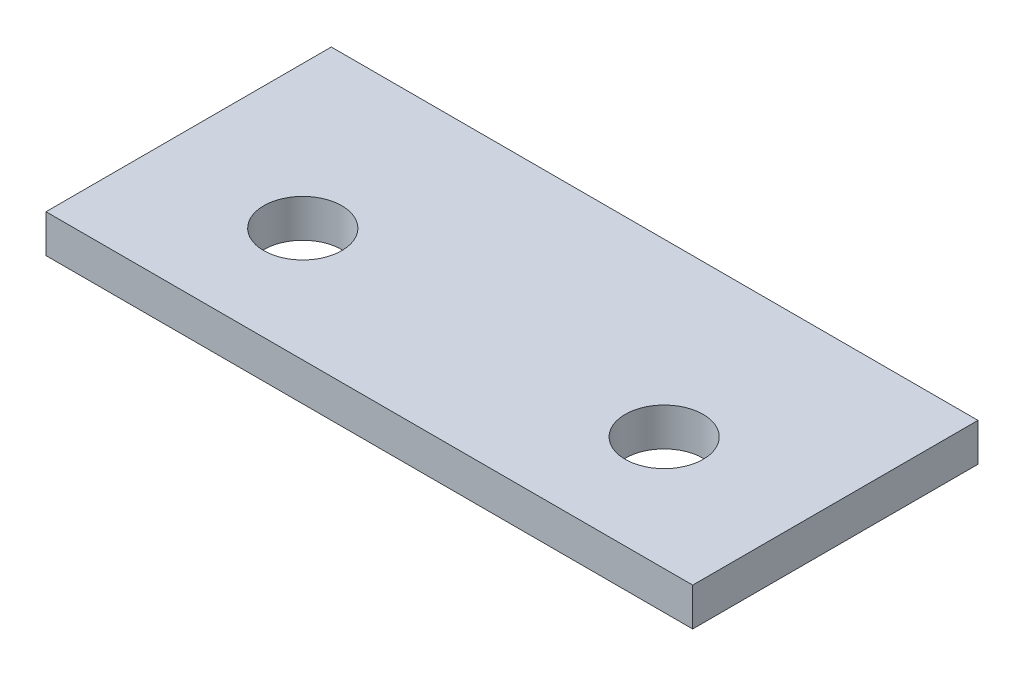
ISO-10303-21;
HEADER;
FILE_DESCRIPTION(('STEP AP214'),'2;1');
FILE_NAME('part.step','',(''),(''),'','','');
FILE_SCHEMA(('AUTOMOTIVE_DESIGN { 1 0 10303 214 1 1 1 1 }'));
ENDSEC;
DATA;
#1=APPLICATION_CONTEXT('core data for automotive mechanical design processes');
#2=APPLICATION_PROTOCOL_DEFINITION('international standard','automotive_design',2000,#1);
#3=PRODUCT_CONTEXT('',#1,'mechanical');
#4=PRODUCT('Part','Part','',(#3));
#5=PRODUCT_RELATED_PRODUCT_CATEGORY('part','',(#4));
#6=PRODUCT_DEFINITION_FORMATION('','',#4);
#7=PRODUCT_DEFINITION_CONTEXT('part definition',#1,'design');
#8=PRODUCT_DEFINITION('design','',#6,#7);
#9=PRODUCT_DEFINITION_SHAPE('','',#8);
#10=(LENGTH_UNIT() NAMED_UNIT(*) SI_UNIT(.MILLI.,.METRE.));
#11=(NAMED_UNIT(*) PLANE_ANGLE_UNIT() SI_UNIT($,.RADIAN.));
#12=(NAMED_UNIT(*) SI_UNIT($,.STERADIAN.) SOLID_ANGLE_UNIT());
#13=UNCERTAINTY_MEASURE_WITH_UNIT(LENGTH_MEASURE(1.E-05),#10,'distance_accuracy_value','');
#14=(GEOMETRIC_REPRESENTATION_CONTEXT(3) GLOBAL_UNCERTAINTY_ASSIGNED_CONTEXT((#13)) GLOBAL_UNIT_ASSIGNED_CONTEXT((#10,
#11,#12)) REPRESENTATION_CONTEXT('',''));
#15=CARTESIAN_POINT('',(0.,0.,0.));
#16=DIRECTION('',(0.,0.,1.));
#17=DIRECTION('',(1.,0.,0.));
#18=AXIS2_PLACEMENT_3D('',#15,#16,#17);
#19=CARTESIAN_POINT('',(0.,4.,0.));
#20=DIRECTION('',(0.,-1.,0.));
#21=DIRECTION('',(0.,0.,-1.));
#22=AXIS2_PLACEMENT_3D('',#19,#20,#21);
#23=PLANE('',#22);
#24=DIRECTION('',(0.,0.,1.));
#25=VECTOR('',#24,1.);
#26=CARTESIAN_POINT('',(0.,4.,0.));
#27=LINE('',#26,#25);
#28=CARTESIAN_POINT('',(0.,4.,-30.));
#29=VERTEX_POINT('',#28);
#30=CARTESIAN_POINT('',(0.,4.,0.));
#31=VERTEX_POINT('',#30);
#32=EDGE_CURVE('E87',#29,#31,#27,.T.);
#33=ORIENTED_EDGE('',*,*,#32,.T.);
#34=DIRECTION('',(1.,0.,0.));
#35=VECTOR('',#34,1.);
#36=CARTESIAN_POINT('',(0.,4.,0.));
#37=LINE('',#36,#35);
#38=CARTESIAN_POINT('',(68.,4.,0.));
#39=VERTEX_POINT('',#38);
#40=EDGE_CURVE('E82',#31,#39,#37,.T.);
#41=ORIENTED_EDGE('',*,*,#40,.T.);
#42=DIRECTION('',(0.,0.,-1.));
#43=VECTOR('',#42,1.);
#44=CARTESIAN_POINT('',(68.,4.,0.));
#45=LINE('',#44,#43);
#46=CARTESIAN_POINT('',(68.,4.,-30.));
#47=VERTEX_POINT('',#46);
#48=EDGE_CURVE('E85',#39,#47,#45,.T.);
#49=ORIENTED_EDGE('',*,*,#48,.T.);
#50=DIRECTION('',(-1.,0.,0.));
#51=VECTOR('',#50,1.);
#52=CARTESIAN_POINT('',(0.,4.,-30.));
#53=LINE('',#52,#51);
#54=EDGE_CURVE('E52',#47,#29,#53,.T.);
#55=ORIENTED_EDGE('',*,*,#54,.T.);
#56=EDGE_LOOP('',(#33,#41,#49,#55));
#57=FACE_BOUND('',#56,.T.);
#58=CARTESIAN_POINT('',(15.,4.,-12.));
#59=DIRECTION('',(0.,1.,0.));
#60=DIRECTION('',(0.,0.,1.));
#61=AXIS2_PLACEMENT_3D('',#58,#59,#60);
#62=CIRCLE('',#61,4.1);
#63=CARTESIAN_POINT('',(15.,4.,-7.9));
#64=VERTEX_POINT('',#63);
#65=EDGE_CURVE('E102',#64,#64,#62,.T.);
#66=ORIENTED_EDGE('',*,*,#65,.F.);
#67=EDGE_LOOP('',(#66));
#68=FACE_BOUND('',#67,.T.);
#69=CARTESIAN_POINT('',(53.,4.,-12.));
#70=DIRECTION('',(0.,1.,0.));
#71=DIRECTION('',(0.,0.,-1.));
#72=AXIS2_PLACEMENT_3D('',#69,#70,#71);
#73=CIRCLE('',#72,4.1);
#74=CARTESIAN_POINT('',(53.,4.,-16.1));
#75=VERTEX_POINT('',#74);
#76=EDGE_CURVE('E117',#75,#75,#73,.T.);
#77=ORIENTED_EDGE('',*,*,#76,.F.);
#78=EDGE_LOOP('',(#77));
#79=FACE_BOUND('',#78,.T.);
#80=ADVANCED_FACE('F35',(#57,#68,#79),#23,.F.);
#81=CARTESIAN_POINT('',(0.,0.,0.));
#82=DIRECTION('',(0.,-1.,0.));
#83=DIRECTION('',(0.,0.,-1.));
#84=AXIS2_PLACEMENT_3D('',#81,#82,#83);
#85=PLANE('',#84);
#86=CARTESIAN_POINT('',(15.,0.,-12.));
#87=DIRECTION('',(0.,1.,0.));
#88=DIRECTION('',(0.,0.,1.));
#89=AXIS2_PLACEMENT_3D('',#86,#87,#88);
#90=CIRCLE('',#89,4.1);
#91=CARTESIAN_POINT('',(15.,0.,-7.9));
#92=VERTEX_POINT('',#91);
#93=EDGE_CURVE('E114',#92,#92,#90,.T.);
#94=ORIENTED_EDGE('',*,*,#93,.T.);
#95=EDGE_LOOP('',(#94));
#96=FACE_BOUND('',#95,.T.);
#97=DIRECTION('',(0.,0.,1.));
#98=VECTOR('',#97,1.);
#99=CARTESIAN_POINT('',(0.,0.,0.));
#100=LINE('',#99,#98);
#101=CARTESIAN_POINT('',(0.,0.,-30.));
#102=VERTEX_POINT('',#101);
#103=CARTESIAN_POINT('',(0.,0.,0.));
#104=VERTEX_POINT('',#103);
#105=EDGE_CURVE('E99',#102,#104,#100,.T.);
#106=ORIENTED_EDGE('',*,*,#105,.F.);
#107=DIRECTION('',(-1.,0.,0.));
#108=VECTOR('',#107,1.);
#109=CARTESIAN_POINT('',(0.,0.,-30.));
#110=LINE('',#109,#108);
#111=CARTESIAN_POINT('',(68.,0.,-30.));
#112=VERTEX_POINT('',#111);
#113=EDGE_CURVE('E75',#112,#102,#110,.T.);
#114=ORIENTED_EDGE('',*,*,#113,.F.);
#115=DIRECTION('',(0.,0.,-1.));
#116=VECTOR('',#115,1.);
#117=CARTESIAN_POINT('',(68.,0.,0.));
#118=LINE('',#117,#116);
#119=CARTESIAN_POINT('',(68.,0.,0.));
#120=VERTEX_POINT('',#119);
#121=EDGE_CURVE('E69',#120,#112,#118,.T.);
#122=ORIENTED_EDGE('',*,*,#121,.F.);
#123=DIRECTION('',(1.,0.,0.));
#124=VECTOR('',#123,1.);
#125=CARTESIAN_POINT('',(0.,0.,0.));
#126=LINE('',#125,#124);
#127=EDGE_CURVE('E91',#104,#120,#126,.T.);
#128=ORIENTED_EDGE('',*,*,#127,.F.);
#129=EDGE_LOOP('',(#106,#114,#122,#128));
#130=FACE_BOUND('',#129,.T.);
#131=CARTESIAN_POINT('',(53.,0.,-12.));
#132=DIRECTION('',(0.,1.,0.));
#133=DIRECTION('',(0.,0.,-1.));
#134=AXIS2_PLACEMENT_3D('',#131,#132,#133);
#135=CIRCLE('',#134,4.1);
#136=CARTESIAN_POINT('',(53.,0.,-16.1));
#137=VERTEX_POINT('',#136);
#138=EDGE_CURVE('E120',#137,#137,#135,.T.);
#139=ORIENTED_EDGE('',*,*,#138,.T.);
#140=EDGE_LOOP('',(#139));
#141=FACE_BOUND('',#140,.T.);
#142=ADVANCED_FACE('F110',(#96,#130,#141),#85,.T.);
#143=CARTESIAN_POINT('',(0.,4.,0.));
#144=DIRECTION('',(1.,0.,0.));
#145=DIRECTION('',(0.,0.,-1.));
#146=AXIS2_PLACEMENT_3D('',#143,#144,#145);
#147=PLANE('',#146);
#148=ORIENTED_EDGE('',*,*,#105,.T.);
#149=DIRECTION('',(0.,-1.,0.));
#150=VECTOR('',#149,1.);
#151=CARTESIAN_POINT('',(0.,4.,0.));
#152=LINE('',#151,#150);
#153=EDGE_CURVE('E11',#31,#104,#152,.T.);
#154=ORIENTED_EDGE('',*,*,#153,.F.);
#155=ORIENTED_EDGE('',*,*,#32,.F.);
#156=DIRECTION('',(0.,-1.,0.));
#157=VECTOR('',#156,1.);
#158=CARTESIAN_POINT('',(0.,4.,-30.));
#159=LINE('',#158,#157);
#160=EDGE_CURVE('E95',#29,#102,#159,.T.);
#161=ORIENTED_EDGE('',*,*,#160,.T.);
#162=EDGE_LOOP('',(#148,#154,#155,#161));
#163=FACE_BOUND('',#162,.T.);
#164=ADVANCED_FACE('F37',(#163),#147,.F.);
#165=CARTESIAN_POINT('',(0.,4.,0.));
#166=DIRECTION('',(0.,0.,-1.));
#167=DIRECTION('',(-1.,0.,0.));
#168=AXIS2_PLACEMENT_3D('',#165,#166,#167);
#169=PLANE('',#168);
#170=ORIENTED_EDGE('',*,*,#127,.T.);
#171=DIRECTION('',(0.,-1.,0.));
#172=VECTOR('',#171,1.);
#173=CARTESIAN_POINT('',(68.,4.,0.));
#174=LINE('',#173,#172);
#175=EDGE_CURVE('E44',#39,#120,#174,.T.);
#176=ORIENTED_EDGE('',*,*,#175,.F.);
#177=ORIENTED_EDGE('',*,*,#40,.F.);
#178=ORIENTED_EDGE('',*,*,#153,.T.);
#179=EDGE_LOOP('',(#170,#176,#177,#178));
#180=FACE_BOUND('',#179,.T.);
#181=ADVANCED_FACE('F90',(#180),#169,.F.);
#182=CARTESIAN_POINT('',(68.,4.,0.));
#183=DIRECTION('',(-1.,0.,0.));
#184=DIRECTION('',(0.,0.,1.));
#185=AXIS2_PLACEMENT_3D('',#182,#183,#184);
#186=PLANE('',#185);
#187=ORIENTED_EDGE('',*,*,#121,.T.);
#188=DIRECTION('',(0.,-1.,0.));
#189=VECTOR('',#188,1.);
#190=CARTESIAN_POINT('',(68.,4.,-30.));
#191=LINE('',#190,#189);
#192=EDGE_CURVE('E92',#47,#112,#191,.T.);
#193=ORIENTED_EDGE('',*,*,#192,.F.);
#194=ORIENTED_EDGE('',*,*,#48,.F.);
#195=ORIENTED_EDGE('',*,*,#175,.T.);
#196=EDGE_LOOP('',(#187,#193,#194,#195));
#197=FACE_BOUND('',#196,.T.);
#198=ADVANCED_FACE('F93',(#197),#186,.F.);
#199=CARTESIAN_POINT('',(0.,4.,-30.));
#200=DIRECTION('',(0.,0.,1.));
#201=DIRECTION('',(1.,0.,0.));
#202=AXIS2_PLACEMENT_3D('',#199,#200,#201);
#203=PLANE('',#202);
#204=ORIENTED_EDGE('',*,*,#113,.T.);
#205=ORIENTED_EDGE('',*,*,#160,.F.);
#206=ORIENTED_EDGE('',*,*,#54,.F.);
#207=ORIENTED_EDGE('',*,*,#192,.T.);
#208=EDGE_LOOP('',(#204,#205,#206,#207));
#209=FACE_BOUND('',#208,.T.);
#210=ADVANCED_FACE('F107',(#209),#203,.F.);
#211=CARTESIAN_POINT('',(15.,4.,-12.));
#212=DIRECTION('',(0.,-1.,0.));
#213=DIRECTION('',(0.,0.,-1.));
#214=AXIS2_PLACEMENT_3D('',#211,#212,#213);
#215=CYLINDRICAL_SURFACE('',#214,4.1);
#216=ORIENTED_EDGE('',*,*,#65,.T.);
#217=EDGE_LOOP('',(#216));
#218=FACE_BOUND('',#217,.T.);
#219=ORIENTED_EDGE('',*,*,#93,.F.);
#220=EDGE_LOOP('',(#219));
#221=FACE_BOUND('',#220,.T.);
#222=ADVANCED_FACE('F137',(#218,#221),#215,.F.);
#223=CARTESIAN_POINT('',(53.,4.,-12.));
#224=DIRECTION('',(0.,-1.,0.));
#225=DIRECTION('',(0.,0.,-1.));
#226=AXIS2_PLACEMENT_3D('',#223,#224,#225);
#227=CYLINDRICAL_SURFACE('',#226,4.1);
#228=ORIENTED_EDGE('',*,*,#76,.T.);
#229=EDGE_LOOP('',(#228));
#230=FACE_BOUND('',#229,.T.);
#231=ORIENTED_EDGE('',*,*,#138,.F.);
#232=EDGE_LOOP('',(#231));
#233=FACE_BOUND('',#232,.T.);
#234=ADVANCED_FACE('F126',(#230,#233),#227,.F.);
#235=CLOSED_SHELL('',(#80,#142,#164,#181,#198,#210,#222,#234));
#236=MANIFOLD_SOLID_BREP('B2',#235);
#237=ADVANCED_BREP_SHAPE_REPRESENTATION('',(#18,#236),#14);
#238=SHAPE_DEFINITION_REPRESENTATION(#9,#237);
ENDSEC;
END-ISO-10303-21;
